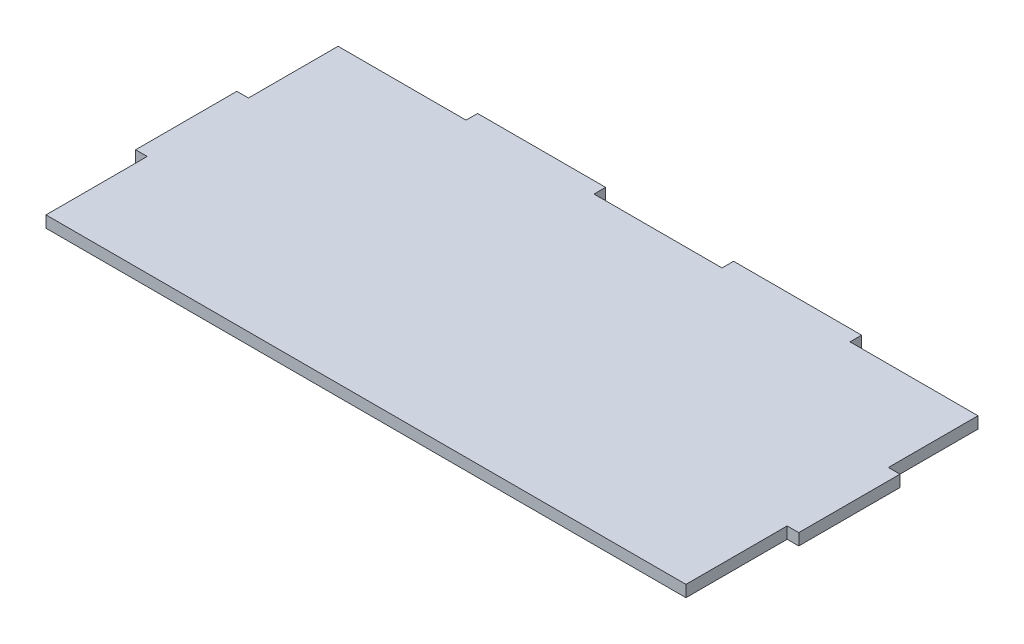
ISO-10303-21;
HEADER;
FILE_DESCRIPTION(('STEP AP214'),'2;1');
FILE_NAME('part.step','',(''),(''),'','','');
FILE_SCHEMA(('AUTOMOTIVE_DESIGN { 1 0 10303 214 1 1 1 1 }'));
ENDSEC;
DATA;
#1=APPLICATION_CONTEXT('core data for automotive mechanical design processes');
#2=APPLICATION_PROTOCOL_DEFINITION('international standard','automotive_design',2000,#1);
#3=PRODUCT_CONTEXT('',#1,'mechanical');
#4=PRODUCT('Part','Part','',(#3));
#5=PRODUCT_RELATED_PRODUCT_CATEGORY('part','',(#4));
#6=PRODUCT_DEFINITION_FORMATION('','',#4);
#7=PRODUCT_DEFINITION_CONTEXT('part definition',#1,'design');
#8=PRODUCT_DEFINITION('design','',#6,#7);
#9=PRODUCT_DEFINITION_SHAPE('','',#8);
#10=(LENGTH_UNIT() NAMED_UNIT(*) SI_UNIT(.MILLI.,.METRE.));
#11=(NAMED_UNIT(*) PLANE_ANGLE_UNIT() SI_UNIT($,.RADIAN.));
#12=(NAMED_UNIT(*) SI_UNIT($,.STERADIAN.) SOLID_ANGLE_UNIT());
#13=UNCERTAINTY_MEASURE_WITH_UNIT(LENGTH_MEASURE(1.E-05),#10,'distance_accuracy_value','');
#14=(GEOMETRIC_REPRESENTATION_CONTEXT(3) GLOBAL_UNCERTAINTY_ASSIGNED_CONTEXT((#13)) GLOBAL_UNIT_ASSIGNED_CONTEXT((#10,
#11,#12)) REPRESENTATION_CONTEXT('',''));
#15=CARTESIAN_POINT('',(0.,0.,0.));
#16=DIRECTION('',(0.,0.,1.));
#17=DIRECTION('',(1.,0.,0.));
#18=AXIS2_PLACEMENT_3D('',#15,#16,#17);
#19=CARTESIAN_POINT('',(-7.69999999999999,2.7,-18.5666666666667));
#20=DIRECTION('',(0.,0.,-1.));
#21=DIRECTION('',(-1.,0.,0.));
#22=AXIS2_PLACEMENT_3D('',#19,#20,#21);
#23=PLANE('',#22);
#24=DIRECTION('',(1.,0.,0.));
#25=VECTOR('',#24,1.);
#26=CARTESIAN_POINT('',(-7.69999999999999,0.,-18.5666666666667));
#27=LINE('',#26,#25);
#28=CARTESIAN_POINT('',(-7.69999999999999,0.,-18.5666666666667));
#29=VERTEX_POINT('',#28);
#30=CARTESIAN_POINT('',(-5.,0.,-18.5666666666667));
#31=VERTEX_POINT('',#30);
#32=EDGE_CURVE('E201',#29,#31,#27,.T.);
#33=ORIENTED_EDGE('',*,*,#32,.T.);
#34=DIRECTION('',(0.,-1.,0.));
#35=VECTOR('',#34,1.);
#36=CARTESIAN_POINT('',(-5.,2.7,-18.5666666666667));
#37=LINE('',#36,#35);
#38=CARTESIAN_POINT('',(-5.,2.7,-18.5666666666667));
#39=VERTEX_POINT('',#38);
#40=EDGE_CURVE('E11',#39,#31,#37,.T.);
#41=ORIENTED_EDGE('',*,*,#40,.F.);
#42=DIRECTION('',(1.,0.,0.));
#43=VECTOR('',#42,1.);
#44=CARTESIAN_POINT('',(-7.69999999999999,2.7,-18.5666666666667));
#45=LINE('',#44,#43);
#46=CARTESIAN_POINT('',(-7.69999999999999,2.7,-18.5666666666667));
#47=VERTEX_POINT('',#46);
#48=EDGE_CURVE('E241',#47,#39,#45,.T.);
#49=ORIENTED_EDGE('',*,*,#48,.F.);
#50=DIRECTION('',(0.,-1.,0.));
#51=VECTOR('',#50,1.);
#52=CARTESIAN_POINT('',(-7.69999999999999,2.7,-18.5666666666667));
#53=LINE('',#52,#51);
#54=EDGE_CURVE('E197',#47,#29,#53,.T.);
#55=ORIENTED_EDGE('',*,*,#54,.T.);
#56=EDGE_LOOP('',(#33,#41,#49,#55));
#57=FACE_BOUND('',#56,.T.);
#58=ADVANCED_FACE('F33',(#57),#23,.F.);
#59=CARTESIAN_POINT('',(-5.,2.7,-18.5666666666667));
#60=DIRECTION('',(1.,0.,0.));
#61=DIRECTION('',(0.,0.,-1.));
#62=AXIS2_PLACEMENT_3D('',#59,#60,#61);
#63=PLANE('',#62);
#64=DIRECTION('',(0.,0.,1.));
#65=VECTOR('',#64,1.);
#66=CARTESIAN_POINT('',(-5.,0.,-18.5666666666667));
#67=LINE('',#66,#65);
#68=CARTESIAN_POINT('',(-5.,0.,5.));
#69=VERTEX_POINT('',#68);
#70=EDGE_CURVE('E204',#31,#69,#67,.T.);
#71=ORIENTED_EDGE('',*,*,#70,.T.);
#72=DIRECTION('',(0.,-1.,0.));
#73=VECTOR('',#72,1.);
#74=CARTESIAN_POINT('',(-5.,2.7,5.));
#75=LINE('',#74,#73);
#76=CARTESIAN_POINT('',(-5.,2.7,5.));
#77=VERTEX_POINT('',#76);
#78=EDGE_CURVE('E41',#77,#69,#75,.T.);
#79=ORIENTED_EDGE('',*,*,#78,.F.);
#80=DIRECTION('',(0.,0.,1.));
#81=VECTOR('',#80,1.);
#82=CARTESIAN_POINT('',(-5.,2.7,-18.5666666666667));
#83=LINE('',#82,#81);
#84=EDGE_CURVE('E128',#39,#77,#83,.T.);
#85=ORIENTED_EDGE('',*,*,#84,.F.);
#86=ORIENTED_EDGE('',*,*,#40,.T.);
#87=EDGE_LOOP('',(#71,#79,#85,#86));
#88=FACE_BOUND('',#87,.T.);
#89=ADVANCED_FACE('F292',(#88),#63,.F.);
#90=CARTESIAN_POINT('',(115.82,2.7,5.));
#91=DIRECTION('',(0.,0.,-1.));
#92=DIRECTION('',(-1.,0.,0.));
#93=AXIS2_PLACEMENT_3D('',#90,#91,#92);
#94=PLANE('',#93);
#95=DIRECTION('',(1.,0.,0.));
#96=VECTOR('',#95,1.);
#97=CARTESIAN_POINT('',(115.82,0.,5.));
#98=LINE('',#97,#96);
#99=CARTESIAN_POINT('',(144.,0.,5.));
#100=VERTEX_POINT('',#99);
#101=EDGE_CURVE('E207',#69,#100,#98,.T.);
#102=ORIENTED_EDGE('',*,*,#101,.T.);
#103=DIRECTION('',(0.,-1.,0.));
#104=VECTOR('',#103,1.);
#105=CARTESIAN_POINT('',(144.,2.7,5.));
#106=LINE('',#105,#104);
#107=CARTESIAN_POINT('',(144.,2.7,5.));
#108=VERTEX_POINT('',#107);
#109=EDGE_CURVE('E284',#108,#100,#106,.T.);
#110=ORIENTED_EDGE('',*,*,#109,.F.);
#111=DIRECTION('',(1.,0.,0.));
#112=VECTOR('',#111,1.);
#113=CARTESIAN_POINT('',(-5.,2.7,5.));
#114=LINE('',#113,#112);
#115=EDGE_CURVE('E291',#77,#108,#114,.T.);
#116=ORIENTED_EDGE('',*,*,#115,.F.);
#117=ORIENTED_EDGE('',*,*,#78,.T.);
#118=EDGE_LOOP('',(#102,#110,#116,#117));
#119=FACE_BOUND('',#118,.T.);
#120=ADVANCED_FACE('F289',(#119),#94,.F.);
#121=CARTESIAN_POINT('',(144.,2.7,-18.5666666666667));
#122=DIRECTION('',(-1.,0.,0.));
#123=DIRECTION('',(0.,0.,1.));
#124=AXIS2_PLACEMENT_3D('',#121,#122,#123);
#125=PLANE('',#124);
#126=DIRECTION('',(0.,0.,-1.));
#127=VECTOR('',#126,1.);
#128=CARTESIAN_POINT('',(144.,0.,-18.5666666666667));
#129=LINE('',#128,#127);
#130=CARTESIAN_POINT('',(144.,0.,-18.5666666666667));
#131=VERTEX_POINT('',#130);
#132=EDGE_CURVE('E209',#100,#131,#129,.T.);
#133=ORIENTED_EDGE('',*,*,#132,.T.);
#134=DIRECTION('',(0.,-1.,0.));
#135=VECTOR('',#134,1.);
#136=CARTESIAN_POINT('',(144.,2.7,-18.5666666666667));
#137=LINE('',#136,#135);
#138=CARTESIAN_POINT('',(144.,2.7,-18.5666666666667));
#139=VERTEX_POINT('',#138);
#140=EDGE_CURVE('E281',#139,#131,#137,.T.);
#141=ORIENTED_EDGE('',*,*,#140,.F.);
#142=DIRECTION('',(0.,0.,-1.));
#143=VECTOR('',#142,1.);
#144=CARTESIAN_POINT('',(144.,2.7,-18.5666666666667));
#145=LINE('',#144,#143);
#146=EDGE_CURVE('E311',#108,#139,#145,.T.);
#147=ORIENTED_EDGE('',*,*,#146,.F.);
#148=ORIENTED_EDGE('',*,*,#109,.T.);
#149=EDGE_LOOP('',(#133,#141,#147,#148));
#150=FACE_BOUND('',#149,.T.);
#151=ADVANCED_FACE('F302',(#150),#125,.F.);
#152=CARTESIAN_POINT('',(146.7,2.7,-18.5666666666667));
#153=DIRECTION('',(0.,0.,-1.));
#154=DIRECTION('',(-1.,0.,0.));
#155=AXIS2_PLACEMENT_3D('',#152,#153,#154);
#156=PLANE('',#155);
#157=DIRECTION('',(1.,0.,0.));
#158=VECTOR('',#157,1.);
#159=CARTESIAN_POINT('',(146.7,0.,-18.5666666666667));
#160=LINE('',#159,#158);
#161=CARTESIAN_POINT('',(146.7,0.,-18.5666666666667));
#162=VERTEX_POINT('',#161);
#163=EDGE_CURVE('E211',#131,#162,#160,.T.);
#164=ORIENTED_EDGE('',*,*,#163,.T.);
#165=DIRECTION('',(0.,-1.,0.));
#166=VECTOR('',#165,1.);
#167=CARTESIAN_POINT('',(146.7,2.7,-18.5666666666667));
#168=LINE('',#167,#166);
#169=CARTESIAN_POINT('',(146.7,2.7,-18.5666666666667));
#170=VERTEX_POINT('',#169);
#171=EDGE_CURVE('E278',#170,#162,#168,.T.);
#172=ORIENTED_EDGE('',*,*,#171,.F.);
#173=DIRECTION('',(1.,0.,0.));
#174=VECTOR('',#173,1.);
#175=CARTESIAN_POINT('',(146.7,2.7,-18.5666666666667));
#176=LINE('',#175,#174);
#177=EDGE_CURVE('E308',#139,#170,#176,.T.);
#178=ORIENTED_EDGE('',*,*,#177,.F.);
#179=ORIENTED_EDGE('',*,*,#140,.T.);
#180=EDGE_LOOP('',(#164,#172,#178,#179));
#181=FACE_BOUND('',#180,.T.);
#182=ADVANCED_FACE('F306',(#181),#156,.F.);
#183=CARTESIAN_POINT('',(146.7,2.7,-18.5666666666667));
#184=DIRECTION('',(-1.,0.,0.));
#185=DIRECTION('',(0.,0.,1.));
#186=AXIS2_PLACEMENT_3D('',#183,#184,#185);
#187=PLANE('',#186);
#188=DIRECTION('',(0.,0.,-1.));
#189=VECTOR('',#188,1.);
#190=CARTESIAN_POINT('',(146.7,0.,-18.5666666666667));
#191=LINE('',#190,#189);
#192=CARTESIAN_POINT('',(146.7,0.,-42.1333333333333));
#193=VERTEX_POINT('',#192);
#194=EDGE_CURVE('E213',#162,#193,#191,.T.);
#195=ORIENTED_EDGE('',*,*,#194,.T.);
#196=DIRECTION('',(0.,-1.,0.));
#197=VECTOR('',#196,1.);
#198=CARTESIAN_POINT('',(146.7,2.7,-42.1333333333333));
#199=LINE('',#198,#197);
#200=CARTESIAN_POINT('',(146.7,2.7,-42.1333333333333));
#201=VERTEX_POINT('',#200);
#202=EDGE_CURVE('E275',#201,#193,#199,.T.);
#203=ORIENTED_EDGE('',*,*,#202,.F.);
#204=DIRECTION('',(0.,0.,-1.));
#205=VECTOR('',#204,1.);
#206=CARTESIAN_POINT('',(146.7,2.7,-18.5666666666667));
#207=LINE('',#206,#205);
#208=EDGE_CURVE('E310',#170,#201,#207,.T.);
#209=ORIENTED_EDGE('',*,*,#208,.F.);
#210=ORIENTED_EDGE('',*,*,#171,.T.);
#211=EDGE_LOOP('',(#195,#203,#209,#210));
#212=FACE_BOUND('',#211,.T.);
#213=ADVANCED_FACE('F390',(#212),#187,.F.);
#214=CARTESIAN_POINT('',(146.7,2.7,-42.1333333333333));
#215=DIRECTION('',(0.,0.,1.));
#216=DIRECTION('',(1.,0.,0.));
#217=AXIS2_PLACEMENT_3D('',#214,#215,#216);
#218=PLANE('',#217);
#219=DIRECTION('',(-1.,0.,0.));
#220=VECTOR('',#219,1.);
#221=CARTESIAN_POINT('',(146.7,0.,-42.1333333333333));
#222=LINE('',#221,#220);
#223=CARTESIAN_POINT('',(144.,0.,-42.1333333333333));
#224=VERTEX_POINT('',#223);
#225=EDGE_CURVE('E215',#193,#224,#222,.T.);
#226=ORIENTED_EDGE('',*,*,#225,.T.);
#227=DIRECTION('',(0.,-1.,0.));
#228=VECTOR('',#227,1.);
#229=CARTESIAN_POINT('',(144.,2.7,-42.1333333333333));
#230=LINE('',#229,#228);
#231=CARTESIAN_POINT('',(144.,2.7,-42.1333333333333));
#232=VERTEX_POINT('',#231);
#233=EDGE_CURVE('E272',#232,#224,#230,.T.);
#234=ORIENTED_EDGE('',*,*,#233,.F.);
#235=DIRECTION('',(-1.,0.,0.));
#236=VECTOR('',#235,1.);
#237=CARTESIAN_POINT('',(146.7,2.7,-42.1333333333333));
#238=LINE('',#237,#236);
#239=EDGE_CURVE('E313',#201,#232,#238,.T.);
#240=ORIENTED_EDGE('',*,*,#239,.F.);
#241=ORIENTED_EDGE('',*,*,#202,.T.);
#242=EDGE_LOOP('',(#226,#234,#240,#241));
#243=FACE_BOUND('',#242,.T.);
#244=ADVANCED_FACE('F386',(#243),#218,.F.);
#245=CARTESIAN_POINT('',(144.,2.7,-63.));
#246=DIRECTION('',(-1.,0.,0.));
#247=DIRECTION('',(0.,0.,1.));
#248=AXIS2_PLACEMENT_3D('',#245,#246,#247);
#249=PLANE('',#248);
#250=DIRECTION('',(0.,0.,-1.));
#251=VECTOR('',#250,1.);
#252=CARTESIAN_POINT('',(144.,0.,-63.));
#253=LINE('',#252,#251);
#254=CARTESIAN_POINT('',(144.,0.,-63.));
#255=VERTEX_POINT('',#254);
#256=EDGE_CURVE('E217',#224,#255,#253,.T.);
#257=ORIENTED_EDGE('',*,*,#256,.T.);
#258=DIRECTION('',(0.,-1.,0.));
#259=VECTOR('',#258,1.);
#260=CARTESIAN_POINT('',(144.,2.7,-63.));
#261=LINE('',#260,#259);
#262=CARTESIAN_POINT('',(144.,2.7,-63.));
#263=VERTEX_POINT('',#262);
#264=EDGE_CURVE('E269',#263,#255,#261,.T.);
#265=ORIENTED_EDGE('',*,*,#264,.F.);
#266=DIRECTION('',(0.,0.,-1.));
#267=VECTOR('',#266,1.);
#268=CARTESIAN_POINT('',(144.,2.7,-63.));
#269=LINE('',#268,#267);
#270=EDGE_CURVE('E319',#232,#263,#269,.T.);
#271=ORIENTED_EDGE('',*,*,#270,.F.);
#272=ORIENTED_EDGE('',*,*,#233,.T.);
#273=EDGE_LOOP('',(#257,#265,#271,#272));
#274=FACE_BOUND('',#273,.T.);
#275=ADVANCED_FACE('F382',(#274),#249,.F.);
#276=CARTESIAN_POINT('',(114.2,2.7,-63.));
#277=DIRECTION('',(0.,0.,1.));
#278=DIRECTION('',(1.,0.,0.));
#279=AXIS2_PLACEMENT_3D('',#276,#277,#278);
#280=PLANE('',#279);
#281=DIRECTION('',(-1.,0.,0.));
#282=VECTOR('',#281,1.);
#283=CARTESIAN_POINT('',(114.2,0.,-63.));
#284=LINE('',#283,#282);
#285=CARTESIAN_POINT('',(114.2,0.,-63.));
#286=VERTEX_POINT('',#285);
#287=EDGE_CURVE('E219',#255,#286,#284,.T.);
#288=ORIENTED_EDGE('',*,*,#287,.T.);
#289=DIRECTION('',(0.,-1.,0.));
#290=VECTOR('',#289,1.);
#291=CARTESIAN_POINT('',(114.2,2.7,-63.));
#292=LINE('',#291,#290);
#293=CARTESIAN_POINT('',(114.2,2.7,-63.));
#294=VERTEX_POINT('',#293);
#295=EDGE_CURVE('E266',#294,#286,#292,.T.);
#296=ORIENTED_EDGE('',*,*,#295,.F.);
#297=DIRECTION('',(-1.,0.,0.));
#298=VECTOR('',#297,1.);
#299=CARTESIAN_POINT('',(114.2,2.7,-63.));
#300=LINE('',#299,#298);
#301=EDGE_CURVE('E321',#263,#294,#300,.T.);
#302=ORIENTED_EDGE('',*,*,#301,.F.);
#303=ORIENTED_EDGE('',*,*,#264,.T.);
#304=EDGE_LOOP('',(#288,#296,#302,#303));
#305=FACE_BOUND('',#304,.T.);
#306=ADVANCED_FACE('F378',(#305),#280,.F.);
#307=CARTESIAN_POINT('',(114.2,2.7,-65.7));
#308=DIRECTION('',(-1.,0.,0.));
#309=DIRECTION('',(0.,0.,1.));
#310=AXIS2_PLACEMENT_3D('',#307,#308,#309);
#311=PLANE('',#310);
#312=DIRECTION('',(0.,0.,-1.));
#313=VECTOR('',#312,1.);
#314=CARTESIAN_POINT('',(114.2,0.,-65.7));
#315=LINE('',#314,#313);
#316=CARTESIAN_POINT('',(114.2,0.,-65.7));
#317=VERTEX_POINT('',#316);
#318=EDGE_CURVE('E221',#286,#317,#315,.T.);
#319=ORIENTED_EDGE('',*,*,#318,.T.);
#320=DIRECTION('',(0.,-1.,0.));
#321=VECTOR('',#320,1.);
#322=CARTESIAN_POINT('',(114.2,2.7,-65.7));
#323=LINE('',#322,#321);
#324=CARTESIAN_POINT('',(114.2,2.7,-65.7));
#325=VERTEX_POINT('',#324);
#326=EDGE_CURVE('E263',#325,#317,#323,.T.);
#327=ORIENTED_EDGE('',*,*,#326,.F.);
#328=DIRECTION('',(0.,0.,-1.));
#329=VECTOR('',#328,1.);
#330=CARTESIAN_POINT('',(114.2,2.7,-65.7));
#331=LINE('',#330,#329);
#332=EDGE_CURVE('E323',#294,#325,#331,.T.);
#333=ORIENTED_EDGE('',*,*,#332,.F.);
#334=ORIENTED_EDGE('',*,*,#295,.T.);
#335=EDGE_LOOP('',(#319,#327,#333,#334));
#336=FACE_BOUND('',#335,.T.);
#337=ADVANCED_FACE('F373',(#336),#311,.F.);
#338=CARTESIAN_POINT('',(84.4,2.7,-65.7));
#339=DIRECTION('',(0.,0.,1.));
#340=DIRECTION('',(1.,0.,0.));
#341=AXIS2_PLACEMENT_3D('',#338,#339,#340);
#342=PLANE('',#341);
#343=DIRECTION('',(-1.,0.,0.));
#344=VECTOR('',#343,1.);
#345=CARTESIAN_POINT('',(84.4,0.,-65.7));
#346=LINE('',#345,#344);
#347=CARTESIAN_POINT('',(84.4,0.,-65.7));
#348=VERTEX_POINT('',#347);
#349=EDGE_CURVE('E223',#317,#348,#346,.T.);
#350=ORIENTED_EDGE('',*,*,#349,.T.);
#351=DIRECTION('',(0.,-1.,0.));
#352=VECTOR('',#351,1.);
#353=CARTESIAN_POINT('',(84.4,2.7,-65.7));
#354=LINE('',#353,#352);
#355=CARTESIAN_POINT('',(84.4,2.7,-65.7));
#356=VERTEX_POINT('',#355);
#357=EDGE_CURVE('E260',#356,#348,#354,.T.);
#358=ORIENTED_EDGE('',*,*,#357,.F.);
#359=DIRECTION('',(-1.,0.,0.));
#360=VECTOR('',#359,1.);
#361=CARTESIAN_POINT('',(84.4,2.7,-65.7));
#362=LINE('',#361,#360);
#363=EDGE_CURVE('E325',#325,#356,#362,.T.);
#364=ORIENTED_EDGE('',*,*,#363,.F.);
#365=ORIENTED_EDGE('',*,*,#326,.T.);
#366=EDGE_LOOP('',(#350,#358,#364,#365));
#367=FACE_BOUND('',#366,.T.);
#368=ADVANCED_FACE('F367',(#367),#342,.F.);
#369=CARTESIAN_POINT('',(84.4,2.7,-65.7));
#370=DIRECTION('',(1.,0.,0.));
#371=DIRECTION('',(0.,0.,-1.));
#372=AXIS2_PLACEMENT_3D('',#369,#370,#371);
#373=PLANE('',#372);
#374=DIRECTION('',(0.,0.,1.));
#375=VECTOR('',#374,1.);
#376=CARTESIAN_POINT('',(84.4,0.,-65.7));
#377=LINE('',#376,#375);
#378=CARTESIAN_POINT('',(84.4,0.,-63.));
#379=VERTEX_POINT('',#378);
#380=EDGE_CURVE('E225',#348,#379,#377,.T.);
#381=ORIENTED_EDGE('',*,*,#380,.T.);
#382=DIRECTION('',(0.,-1.,0.));
#383=VECTOR('',#382,1.);
#384=CARTESIAN_POINT('',(84.4,2.7,-63.));
#385=LINE('',#384,#383);
#386=CARTESIAN_POINT('',(84.4,2.7,-63.));
#387=VERTEX_POINT('',#386);
#388=EDGE_CURVE('E257',#387,#379,#385,.T.);
#389=ORIENTED_EDGE('',*,*,#388,.F.);
#390=DIRECTION('',(0.,0.,1.));
#391=VECTOR('',#390,1.);
#392=CARTESIAN_POINT('',(84.4,2.7,-65.7));
#393=LINE('',#392,#391);
#394=EDGE_CURVE('E327',#356,#387,#393,.T.);
#395=ORIENTED_EDGE('',*,*,#394,.F.);
#396=ORIENTED_EDGE('',*,*,#357,.T.);
#397=EDGE_LOOP('',(#381,#389,#395,#396));
#398=FACE_BOUND('',#397,.T.);
#399=ADVANCED_FACE('F362',(#398),#373,.F.);
#400=CARTESIAN_POINT('',(54.6,2.7,-63.));
#401=DIRECTION('',(0.,0.,1.));
#402=DIRECTION('',(1.,0.,0.));
#403=AXIS2_PLACEMENT_3D('',#400,#401,#402);
#404=PLANE('',#403);
#405=DIRECTION('',(-1.,0.,0.));
#406=VECTOR('',#405,1.);
#407=CARTESIAN_POINT('',(54.6,0.,-63.));
#408=LINE('',#407,#406);
#409=CARTESIAN_POINT('',(54.6,0.,-63.));
#410=VERTEX_POINT('',#409);
#411=EDGE_CURVE('E228',#379,#410,#408,.T.);
#412=ORIENTED_EDGE('',*,*,#411,.T.);
#413=DIRECTION('',(0.,-1.,0.));
#414=VECTOR('',#413,1.);
#415=CARTESIAN_POINT('',(54.6,2.7,-63.));
#416=LINE('',#415,#414);
#417=CARTESIAN_POINT('',(54.6,2.7,-63.));
#418=VERTEX_POINT('',#417);
#419=EDGE_CURVE('E254',#418,#410,#416,.T.);
#420=ORIENTED_EDGE('',*,*,#419,.F.);
#421=DIRECTION('',(-1.,0.,0.));
#422=VECTOR('',#421,1.);
#423=CARTESIAN_POINT('',(74.5,2.7,-63.));
#424=LINE('',#423,#422);
#425=EDGE_CURVE('E329',#387,#418,#424,.T.);
#426=ORIENTED_EDGE('',*,*,#425,.F.);
#427=ORIENTED_EDGE('',*,*,#388,.T.);
#428=EDGE_LOOP('',(#412,#420,#426,#427));
#429=FACE_BOUND('',#428,.T.);
#430=ADVANCED_FACE('F357',(#429),#404,.F.);
#431=CARTESIAN_POINT('',(54.6,2.7,-65.7));
#432=DIRECTION('',(-1.,0.,0.));
#433=DIRECTION('',(0.,0.,1.));
#434=AXIS2_PLACEMENT_3D('',#431,#432,#433);
#435=PLANE('',#434);
#436=DIRECTION('',(0.,0.,-1.));
#437=VECTOR('',#436,1.);
#438=CARTESIAN_POINT('',(54.6,0.,-65.7));
#439=LINE('',#438,#437);
#440=CARTESIAN_POINT('',(54.6,0.,-65.7));
#441=VERTEX_POINT('',#440);
#442=EDGE_CURVE('E230',#410,#441,#439,.T.);
#443=ORIENTED_EDGE('',*,*,#442,.T.);
#444=DIRECTION('',(0.,-1.,0.));
#445=VECTOR('',#444,1.);
#446=CARTESIAN_POINT('',(54.6,2.7,-65.7));
#447=LINE('',#446,#445);
#448=CARTESIAN_POINT('',(54.6,2.7,-65.7));
#449=VERTEX_POINT('',#448);
#450=EDGE_CURVE('E251',#449,#441,#447,.T.);
#451=ORIENTED_EDGE('',*,*,#450,.F.);
#452=DIRECTION('',(0.,0.,-1.));
#453=VECTOR('',#452,1.);
#454=CARTESIAN_POINT('',(54.6,2.7,-65.7));
#455=LINE('',#454,#453);
#456=EDGE_CURVE('E331',#418,#449,#455,.T.);
#457=ORIENTED_EDGE('',*,*,#456,.F.);
#458=ORIENTED_EDGE('',*,*,#419,.T.);
#459=EDGE_LOOP('',(#443,#451,#457,#458));
#460=FACE_BOUND('',#459,.T.);
#461=ADVANCED_FACE('F353',(#460),#435,.F.);
#462=CARTESIAN_POINT('',(24.8,2.7,-65.7));
#463=DIRECTION('',(0.,0.,1.));
#464=DIRECTION('',(1.,0.,0.));
#465=AXIS2_PLACEMENT_3D('',#462,#463,#464);
#466=PLANE('',#465);
#467=DIRECTION('',(-1.,0.,0.));
#468=VECTOR('',#467,1.);
#469=CARTESIAN_POINT('',(24.8,0.,-65.7));
#470=LINE('',#469,#468);
#471=CARTESIAN_POINT('',(24.8,0.,-65.7));
#472=VERTEX_POINT('',#471);
#473=EDGE_CURVE('E232',#441,#472,#470,.T.);
#474=ORIENTED_EDGE('',*,*,#473,.T.);
#475=DIRECTION('',(0.,-1.,0.));
#476=VECTOR('',#475,1.);
#477=CARTESIAN_POINT('',(24.8,2.7,-65.7));
#478=LINE('',#477,#476);
#479=CARTESIAN_POINT('',(24.8,2.7,-65.7));
#480=VERTEX_POINT('',#479);
#481=EDGE_CURVE('E248',#480,#472,#478,.T.);
#482=ORIENTED_EDGE('',*,*,#481,.F.);
#483=DIRECTION('',(-1.,0.,0.));
#484=VECTOR('',#483,1.);
#485=CARTESIAN_POINT('',(24.8,2.7,-65.7));
#486=LINE('',#485,#484);
#487=EDGE_CURVE('E333',#449,#480,#486,.T.);
#488=ORIENTED_EDGE('',*,*,#487,.F.);
#489=ORIENTED_EDGE('',*,*,#450,.T.);
#490=EDGE_LOOP('',(#474,#482,#488,#489));
#491=FACE_BOUND('',#490,.T.);
#492=ADVANCED_FACE('F349',(#491),#466,.F.);
#493=CARTESIAN_POINT('',(24.8,2.7,-65.7));
#494=DIRECTION('',(1.,0.,0.));
#495=DIRECTION('',(0.,0.,-1.));
#496=AXIS2_PLACEMENT_3D('',#493,#494,#495);
#497=PLANE('',#496);
#498=DIRECTION('',(0.,0.,1.));
#499=VECTOR('',#498,1.);
#500=CARTESIAN_POINT('',(24.8,0.,-65.7));
#501=LINE('',#500,#499);
#502=CARTESIAN_POINT('',(24.8,0.,-63.));
#503=VERTEX_POINT('',#502);
#504=EDGE_CURVE('E234',#472,#503,#501,.T.);
#505=ORIENTED_EDGE('',*,*,#504,.T.);
#506=DIRECTION('',(0.,-1.,0.));
#507=VECTOR('',#506,1.);
#508=CARTESIAN_POINT('',(24.8,2.7,-63.));
#509=LINE('',#508,#507);
#510=CARTESIAN_POINT('',(24.8,2.7,-63.));
#511=VERTEX_POINT('',#510);
#512=EDGE_CURVE('E245',#511,#503,#509,.T.);
#513=ORIENTED_EDGE('',*,*,#512,.F.);
#514=DIRECTION('',(0.,0.,1.));
#515=VECTOR('',#514,1.);
#516=CARTESIAN_POINT('',(24.8,2.7,-65.7));
#517=LINE('',#516,#515);
#518=EDGE_CURVE('E335',#480,#511,#517,.T.);
#519=ORIENTED_EDGE('',*,*,#518,.F.);
#520=ORIENTED_EDGE('',*,*,#481,.T.);
#521=EDGE_LOOP('',(#505,#513,#519,#520));
#522=FACE_BOUND('',#521,.T.);
#523=ADVANCED_FACE('F341',(#522),#497,.F.);
#524=CARTESIAN_POINT('',(-5.,2.7,-63.));
#525=DIRECTION('',(0.,0.,1.));
#526=DIRECTION('',(1.,0.,0.));
#527=AXIS2_PLACEMENT_3D('',#524,#525,#526);
#528=PLANE('',#527);
#529=DIRECTION('',(-1.,0.,0.));
#530=VECTOR('',#529,1.);
#531=CARTESIAN_POINT('',(-5.,0.,-63.));
#532=LINE('',#531,#530);
#533=CARTESIAN_POINT('',(-5.,0.,-63.));
#534=VERTEX_POINT('',#533);
#535=EDGE_CURVE('E236',#503,#534,#532,.T.);
#536=ORIENTED_EDGE('',*,*,#535,.T.);
#537=DIRECTION('',(0.,-1.,0.));
#538=VECTOR('',#537,1.);
#539=CARTESIAN_POINT('',(-5.,2.7,-63.));
#540=LINE('',#539,#538);
#541=CARTESIAN_POINT('',(-5.,2.7,-63.));
#542=VERTEX_POINT('',#541);
#543=EDGE_CURVE('E192',#542,#534,#540,.T.);
#544=ORIENTED_EDGE('',*,*,#543,.F.);
#545=DIRECTION('',(-1.,0.,0.));
#546=VECTOR('',#545,1.);
#547=CARTESIAN_POINT('',(-5.,2.7,-63.));
#548=LINE('',#547,#546);
#549=EDGE_CURVE('E183',#511,#542,#548,.T.);
#550=ORIENTED_EDGE('',*,*,#549,.F.);
#551=ORIENTED_EDGE('',*,*,#512,.T.);
#552=EDGE_LOOP('',(#536,#544,#550,#551));
#553=FACE_BOUND('',#552,.T.);
#554=ADVANCED_FACE('F345',(#553),#528,.F.);
#555=CARTESIAN_POINT('',(-5.,2.7,-63.));
#556=DIRECTION('',(1.,0.,0.));
#557=DIRECTION('',(0.,0.,-1.));
#558=AXIS2_PLACEMENT_3D('',#555,#556,#557);
#559=PLANE('',#558);
#560=DIRECTION('',(0.,0.,1.));
#561=VECTOR('',#560,1.);
#562=CARTESIAN_POINT('',(-5.,0.,-63.));
#563=LINE('',#562,#561);
#564=CARTESIAN_POINT('',(-5.,0.,-42.1333333333333));
#565=VERTEX_POINT('',#564);
#566=EDGE_CURVE('E191',#534,#565,#563,.T.);
#567=ORIENTED_EDGE('',*,*,#566,.T.);
#568=DIRECTION('',(0.,-1.,0.));
#569=VECTOR('',#568,1.);
#570=CARTESIAN_POINT('',(-5.,2.7,-42.1333333333333));
#571=LINE('',#570,#569);
#572=CARTESIAN_POINT('',(-5.,2.7,-42.1333333333333));
#573=VERTEX_POINT('',#572);
#574=EDGE_CURVE('E188',#573,#565,#571,.T.);
#575=ORIENTED_EDGE('',*,*,#574,.F.);
#576=DIRECTION('',(0.,0.,1.));
#577=VECTOR('',#576,1.);
#578=CARTESIAN_POINT('',(-5.,2.7,-63.));
#579=LINE('',#578,#577);
#580=EDGE_CURVE('E177',#542,#573,#579,.T.);
#581=ORIENTED_EDGE('',*,*,#580,.F.);
#582=ORIENTED_EDGE('',*,*,#543,.T.);
#583=EDGE_LOOP('',(#567,#575,#581,#582));
#584=FACE_BOUND('',#583,.T.);
#585=ADVANCED_FACE('F189',(#584),#559,.F.);
#586=CARTESIAN_POINT('',(-7.69999999999999,2.7,-42.1333333333333));
#587=DIRECTION('',(0.,0.,1.));
#588=DIRECTION('',(1.,0.,0.));
#589=AXIS2_PLACEMENT_3D('',#586,#587,#588);
#590=PLANE('',#589);
#591=DIRECTION('',(-1.,0.,0.));
#592=VECTOR('',#591,1.);
#593=CARTESIAN_POINT('',(-7.69999999999999,0.,-42.1333333333333));
#594=LINE('',#593,#592);
#595=CARTESIAN_POINT('',(-7.69999999999999,0.,-42.1333333333333));
#596=VERTEX_POINT('',#595);
#597=EDGE_CURVE('E114',#565,#596,#594,.T.);
#598=ORIENTED_EDGE('',*,*,#597,.T.);
#599=DIRECTION('',(0.,-1.,0.));
#600=VECTOR('',#599,1.);
#601=CARTESIAN_POINT('',(-7.69999999999999,2.7,-42.1333333333333));
#602=LINE('',#601,#600);
#603=CARTESIAN_POINT('',(-7.69999999999999,2.7,-42.1333333333333));
#604=VERTEX_POINT('',#603);
#605=EDGE_CURVE('E193',#604,#596,#602,.T.);
#606=ORIENTED_EDGE('',*,*,#605,.F.);
#607=DIRECTION('',(-1.,0.,0.));
#608=VECTOR('',#607,1.);
#609=CARTESIAN_POINT('',(-7.69999999999999,2.7,-42.1333333333333));
#610=LINE('',#609,#608);
#611=EDGE_CURVE('E181',#573,#604,#610,.T.);
#612=ORIENTED_EDGE('',*,*,#611,.F.);
#613=ORIENTED_EDGE('',*,*,#574,.T.);
#614=EDGE_LOOP('',(#598,#606,#612,#613));
#615=FACE_BOUND('',#614,.T.);
#616=ADVANCED_FACE('F195',(#615),#590,.F.);
#617=CARTESIAN_POINT('',(-7.69999999999999,2.7,-18.5666666666667));
#618=DIRECTION('',(1.,0.,0.));
#619=DIRECTION('',(0.,0.,-1.));
#620=AXIS2_PLACEMENT_3D('',#617,#618,#619);
#621=PLANE('',#620);
#622=DIRECTION('',(0.,0.,1.));
#623=VECTOR('',#622,1.);
#624=CARTESIAN_POINT('',(-7.69999999999999,0.,-18.5666666666667));
#625=LINE('',#624,#623);
#626=EDGE_CURVE('E120',#596,#29,#625,.T.);
#627=ORIENTED_EDGE('',*,*,#626,.T.);
#628=ORIENTED_EDGE('',*,*,#54,.F.);
#629=DIRECTION('',(0.,0.,1.));
#630=VECTOR('',#629,1.);
#631=CARTESIAN_POINT('',(-7.69999999999999,2.7,-18.5666666666667));
#632=LINE('',#631,#630);
#633=EDGE_CURVE('E49',#604,#47,#632,.T.);
#634=ORIENTED_EDGE('',*,*,#633,.F.);
#635=ORIENTED_EDGE('',*,*,#605,.T.);
#636=EDGE_LOOP('',(#627,#628,#634,#635));
#637=FACE_BOUND('',#636,.T.);
#638=ADVANCED_FACE('F405',(#637),#621,.F.);
#639=CARTESIAN_POINT('',(0.,2.7,0.));
#640=DIRECTION('',(0.,-1.,0.));
#641=DIRECTION('',(0.,0.,-1.));
#642=AXIS2_PLACEMENT_3D('',#639,#640,#641);
#643=PLANE('',#642);
#644=ORIENTED_EDGE('',*,*,#48,.T.);
#645=ORIENTED_EDGE('',*,*,#84,.T.);
#646=ORIENTED_EDGE('',*,*,#115,.T.);
#647=ORIENTED_EDGE('',*,*,#146,.T.);
#648=ORIENTED_EDGE('',*,*,#177,.T.);
#649=ORIENTED_EDGE('',*,*,#208,.T.);
#650=ORIENTED_EDGE('',*,*,#239,.T.);
#651=ORIENTED_EDGE('',*,*,#270,.T.);
#652=ORIENTED_EDGE('',*,*,#301,.T.);
#653=ORIENTED_EDGE('',*,*,#332,.T.);
#654=ORIENTED_EDGE('',*,*,#363,.T.);
#655=ORIENTED_EDGE('',*,*,#394,.T.);
#656=ORIENTED_EDGE('',*,*,#425,.T.);
#657=ORIENTED_EDGE('',*,*,#456,.T.);
#658=ORIENTED_EDGE('',*,*,#487,.T.);
#659=ORIENTED_EDGE('',*,*,#518,.T.);
#660=ORIENTED_EDGE('',*,*,#549,.T.);
#661=ORIENTED_EDGE('',*,*,#580,.T.);
#662=ORIENTED_EDGE('',*,*,#611,.T.);
#663=ORIENTED_EDGE('',*,*,#633,.T.);
#664=EDGE_LOOP('',(#644,#645,#646,#647,#648,#649,#650,#651,#652,#653,#654,#655,#656,#657,#658,
#659,#660,#661,#662,#663));
#665=FACE_BOUND('',#664,.T.);
#666=ADVANCED_FACE('F179',(#665),#643,.F.);
#667=CARTESIAN_POINT('',(0.,0.,0.));
#668=DIRECTION('',(0.,-1.,0.));
#669=DIRECTION('',(0.,0.,-1.));
#670=AXIS2_PLACEMENT_3D('',#667,#668,#669);
#671=PLANE('',#670);
#672=ORIENTED_EDGE('',*,*,#32,.F.);
#673=ORIENTED_EDGE('',*,*,#626,.F.);
#674=ORIENTED_EDGE('',*,*,#597,.F.);
#675=ORIENTED_EDGE('',*,*,#566,.F.);
#676=ORIENTED_EDGE('',*,*,#535,.F.);
#677=ORIENTED_EDGE('',*,*,#504,.F.);
#678=ORIENTED_EDGE('',*,*,#473,.F.);
#679=ORIENTED_EDGE('',*,*,#442,.F.);
#680=ORIENTED_EDGE('',*,*,#411,.F.);
#681=ORIENTED_EDGE('',*,*,#380,.F.);
#682=ORIENTED_EDGE('',*,*,#349,.F.);
#683=ORIENTED_EDGE('',*,*,#318,.F.);
#684=ORIENTED_EDGE('',*,*,#287,.F.);
#685=ORIENTED_EDGE('',*,*,#256,.F.);
#686=ORIENTED_EDGE('',*,*,#225,.F.);
#687=ORIENTED_EDGE('',*,*,#194,.F.);
#688=ORIENTED_EDGE('',*,*,#163,.F.);
#689=ORIENTED_EDGE('',*,*,#132,.F.);
#690=ORIENTED_EDGE('',*,*,#101,.F.);
#691=ORIENTED_EDGE('',*,*,#70,.F.);
#692=EDGE_LOOP('',(#672,#673,#674,#675,#676,#677,#678,#679,#680,#681,#682,#683,#684,#685,#686,
#687,#688,#689,#690,#691));
#693=FACE_BOUND('',#692,.T.);
#694=ADVANCED_FACE('F296',(#693),#671,.T.);
#695=CLOSED_SHELL('',(#58,#89,#120,#151,#182,#213,#244,#275,#306,#337,#368,#399,#430,#461,#492,
#523,#554,#585,#616,#638,#666,#694));
#696=MANIFOLD_SOLID_BREP('B2',#695);
#697=ADVANCED_BREP_SHAPE_REPRESENTATION('',(#18,#696),#14);
#698=SHAPE_DEFINITION_REPRESENTATION(#9,#697);
ENDSEC;
END-ISO-10303-21;
